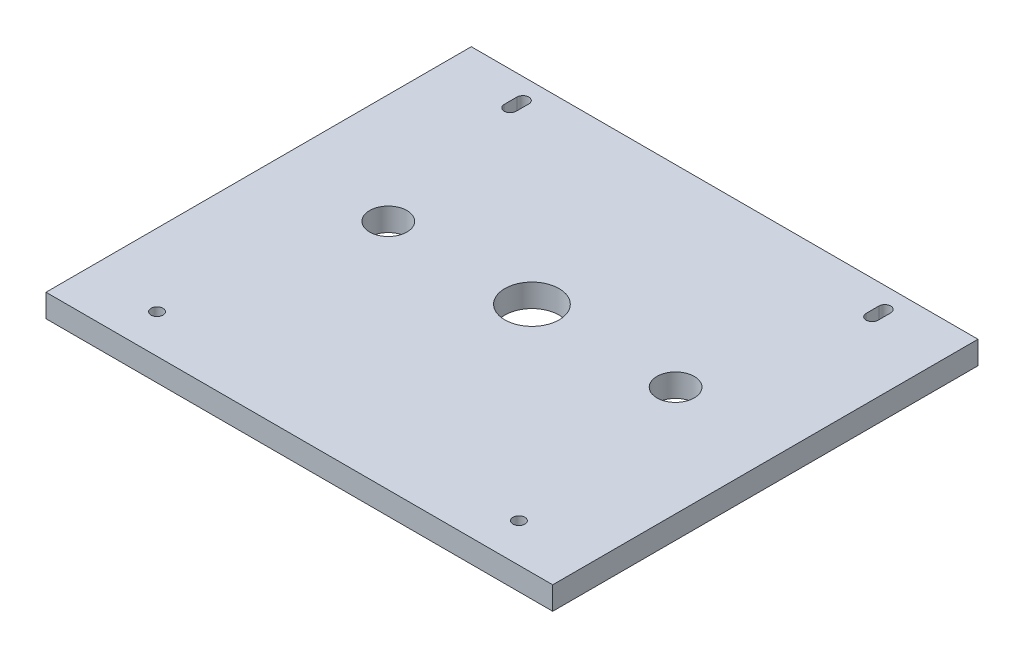
ISO-10303-21;
HEADER;
FILE_DESCRIPTION(('STEP AP214'),'2;1');
FILE_NAME('part.step','',(''),(''),'','','');
FILE_SCHEMA(('AUTOMOTIVE_DESIGN { 1 0 10303 214 1 1 1 1 }'));
ENDSEC;
DATA;
#1=APPLICATION_CONTEXT('core data for automotive mechanical design processes');
#2=APPLICATION_PROTOCOL_DEFINITION('international standard','automotive_design',2000,#1);
#3=PRODUCT_CONTEXT('',#1,'mechanical');
#4=PRODUCT('Part','Part','',(#3));
#5=PRODUCT_RELATED_PRODUCT_CATEGORY('part','',(#4));
#6=PRODUCT_DEFINITION_FORMATION('','',#4);
#7=PRODUCT_DEFINITION_CONTEXT('part definition',#1,'design');
#8=PRODUCT_DEFINITION('design','',#6,#7);
#9=PRODUCT_DEFINITION_SHAPE('','',#8);
#10=(LENGTH_UNIT() NAMED_UNIT(*) SI_UNIT(.MILLI.,.METRE.));
#11=(NAMED_UNIT(*) PLANE_ANGLE_UNIT() SI_UNIT($,.RADIAN.));
#12=(NAMED_UNIT(*) SI_UNIT($,.STERADIAN.) SOLID_ANGLE_UNIT());
#13=UNCERTAINTY_MEASURE_WITH_UNIT(LENGTH_MEASURE(1.E-05),#10,'distance_accuracy_value','');
#14=(GEOMETRIC_REPRESENTATION_CONTEXT(3) GLOBAL_UNCERTAINTY_ASSIGNED_CONTEXT((#13)) GLOBAL_UNIT_ASSIGNED_CONTEXT((#10,
#11,#12)) REPRESENTATION_CONTEXT('',''));
#15=CARTESIAN_POINT('',(0.,0.,0.));
#16=DIRECTION('',(0.,0.,1.));
#17=DIRECTION('',(1.,0.,0.));
#18=AXIS2_PLACEMENT_3D('',#15,#16,#17);
#19=CARTESIAN_POINT('',(0.,6.35,0.));
#20=DIRECTION('',(1.,0.,0.));
#21=DIRECTION('',(0.,0.,-1.));
#22=AXIS2_PLACEMENT_3D('',#19,#20,#21);
#23=PLANE('',#22);
#24=DIRECTION('',(0.,0.,1.));
#25=VECTOR('',#24,1.);
#26=CARTESIAN_POINT('',(0.,0.,0.));
#27=LINE('',#26,#25);
#28=CARTESIAN_POINT('',(0.,0.,-117.505));
#29=VERTEX_POINT('',#28);
#30=CARTESIAN_POINT('',(0.,0.,0.));
#31=VERTEX_POINT('',#30);
#32=EDGE_CURVE('E256',#29,#31,#27,.T.);
#33=ORIENTED_EDGE('',*,*,#32,.T.);
#34=DIRECTION('',(0.,-1.,0.));
#35=VECTOR('',#34,1.);
#36=CARTESIAN_POINT('',(0.,6.35,0.));
#37=LINE('',#36,#35);
#38=CARTESIAN_POINT('',(0.,6.35,0.));
#39=VERTEX_POINT('',#38);
#40=EDGE_CURVE('E11',#39,#31,#37,.T.);
#41=ORIENTED_EDGE('',*,*,#40,.F.);
#42=DIRECTION('',(0.,0.,1.));
#43=VECTOR('',#42,1.);
#44=CARTESIAN_POINT('',(0.,6.35,0.));
#45=LINE('',#44,#43);
#46=CARTESIAN_POINT('',(0.,6.35,-117.505));
#47=VERTEX_POINT('',#46);
#48=EDGE_CURVE('E260',#47,#39,#45,.T.);
#49=ORIENTED_EDGE('',*,*,#48,.F.);
#50=DIRECTION('',(0.,-1.,0.));
#51=VECTOR('',#50,1.);
#52=CARTESIAN_POINT('',(0.,6.35,-117.505));
#53=LINE('',#52,#51);
#54=EDGE_CURVE('E274',#47,#29,#53,.T.);
#55=ORIENTED_EDGE('',*,*,#54,.T.);
#56=EDGE_LOOP('',(#33,#41,#49,#55));
#57=FACE_BOUND('',#56,.T.);
#58=ADVANCED_FACE('F45',(#57),#23,.F.);
#59=CARTESIAN_POINT('',(0.,6.35,0.));
#60=DIRECTION('',(0.,0.,-1.));
#61=DIRECTION('',(-1.,0.,0.));
#62=AXIS2_PLACEMENT_3D('',#59,#60,#61);
#63=PLANE('',#62);
#64=DIRECTION('',(1.,0.,0.));
#65=VECTOR('',#64,1.);
#66=CARTESIAN_POINT('',(0.,0.,0.));
#67=LINE('',#66,#65);
#68=CARTESIAN_POINT('',(140.,0.,0.));
#69=VERTEX_POINT('',#68);
#70=EDGE_CURVE('E278',#31,#69,#67,.T.);
#71=ORIENTED_EDGE('',*,*,#70,.T.);
#72=DIRECTION('',(0.,-1.,0.));
#73=VECTOR('',#72,1.);
#74=CARTESIAN_POINT('',(140.,6.35,0.));
#75=LINE('',#74,#73);
#76=CARTESIAN_POINT('',(140.,6.35,0.));
#77=VERTEX_POINT('',#76);
#78=EDGE_CURVE('E53',#77,#69,#75,.T.);
#79=ORIENTED_EDGE('',*,*,#78,.F.);
#80=DIRECTION('',(1.,0.,0.));
#81=VECTOR('',#80,1.);
#82=CARTESIAN_POINT('',(0.,6.35,0.));
#83=LINE('',#82,#81);
#84=EDGE_CURVE('E264',#39,#77,#83,.T.);
#85=ORIENTED_EDGE('',*,*,#84,.F.);
#86=ORIENTED_EDGE('',*,*,#40,.T.);
#87=EDGE_LOOP('',(#71,#79,#85,#86));
#88=FACE_BOUND('',#87,.T.);
#89=ADVANCED_FACE('F313',(#88),#63,.F.);
#90=CARTESIAN_POINT('',(140.,6.35,0.));
#91=DIRECTION('',(-1.,0.,0.));
#92=DIRECTION('',(0.,0.,1.));
#93=AXIS2_PLACEMENT_3D('',#90,#91,#92);
#94=PLANE('',#93);
#95=DIRECTION('',(0.,0.,-1.));
#96=VECTOR('',#95,1.);
#97=CARTESIAN_POINT('',(140.,0.,0.));
#98=LINE('',#97,#96);
#99=CARTESIAN_POINT('',(140.,0.,-117.505));
#100=VERTEX_POINT('',#99);
#101=EDGE_CURVE('E281',#69,#100,#98,.T.);
#102=ORIENTED_EDGE('',*,*,#101,.T.);
#103=DIRECTION('',(0.,-1.,0.));
#104=VECTOR('',#103,1.);
#105=CARTESIAN_POINT('',(140.,6.35,-117.505));
#106=LINE('',#105,#104);
#107=CARTESIAN_POINT('',(140.,6.35,-117.505));
#108=VERTEX_POINT('',#107);
#109=EDGE_CURVE('E289',#108,#100,#106,.T.);
#110=ORIENTED_EDGE('',*,*,#109,.F.);
#111=DIRECTION('',(0.,0.,-1.));
#112=VECTOR('',#111,1.);
#113=CARTESIAN_POINT('',(140.,6.35,0.));
#114=LINE('',#113,#112);
#115=EDGE_CURVE('E268',#77,#108,#114,.T.);
#116=ORIENTED_EDGE('',*,*,#115,.F.);
#117=ORIENTED_EDGE('',*,*,#78,.T.);
#118=EDGE_LOOP('',(#102,#110,#116,#117));
#119=FACE_BOUND('',#118,.T.);
#120=ADVANCED_FACE('F298',(#119),#94,.F.);
#121=CARTESIAN_POINT('',(0.,6.35,-117.505));
#122=DIRECTION('',(0.,0.,1.));
#123=DIRECTION('',(1.,0.,0.));
#124=AXIS2_PLACEMENT_3D('',#121,#122,#123);
#125=PLANE('',#124);
#126=DIRECTION('',(-1.,0.,0.));
#127=VECTOR('',#126,1.);
#128=CARTESIAN_POINT('',(0.,0.,-117.505));
#129=LINE('',#128,#127);
#130=EDGE_CURVE('E265',#100,#29,#129,.T.);
#131=ORIENTED_EDGE('',*,*,#130,.T.);
#132=ORIENTED_EDGE('',*,*,#54,.F.);
#133=DIRECTION('',(-1.,0.,0.));
#134=VECTOR('',#133,1.);
#135=CARTESIAN_POINT('',(0.,6.35,-117.505));
#136=LINE('',#135,#134);
#137=EDGE_CURVE('E271',#108,#47,#136,.T.);
#138=ORIENTED_EDGE('',*,*,#137,.F.);
#139=ORIENTED_EDGE('',*,*,#109,.T.);
#140=EDGE_LOOP('',(#131,#132,#138,#139));
#141=FACE_BOUND('',#140,.T.);
#142=ADVANCED_FACE('F307',(#141),#125,.F.);
#143=CARTESIAN_POINT('',(0.,6.35,0.));
#144=DIRECTION('',(0.,-1.,0.));
#145=DIRECTION('',(0.,0.,-1.));
#146=AXIS2_PLACEMENT_3D('',#143,#144,#145);
#147=PLANE('',#146);
#148=DIRECTION('',(0.,0.,-1.));
#149=VECTOR('',#148,1.);
#150=CARTESIAN_POINT('',(121.65,6.35,-108.255));
#151=LINE('',#150,#149);
#152=CARTESIAN_POINT('',(121.65,6.35,-108.255));
#153=VERTEX_POINT('',#152);
#154=CARTESIAN_POINT('',(121.65,6.35,-111.755));
#155=VERTEX_POINT('',#154);
#156=EDGE_CURVE('E216',#153,#155,#151,.T.);
#157=ORIENTED_EDGE('',*,*,#156,.F.);
#158=CARTESIAN_POINT('',(120.,6.35,-108.255));
#159=DIRECTION('',(0.,1.,0.));
#160=DIRECTION('',(0.,0.,-1.));
#161=AXIS2_PLACEMENT_3D('',#158,#159,#160);
#162=CIRCLE('',#161,1.65);
#163=CARTESIAN_POINT('',(118.35,6.35,-108.255));
#164=VERTEX_POINT('',#163);
#165=EDGE_CURVE('E60',#164,#153,#162,.T.);
#166=ORIENTED_EDGE('',*,*,#165,.F.);
#167=DIRECTION('',(0.,0.,1.));
#168=VECTOR('',#167,1.);
#169=CARTESIAN_POINT('',(118.35,6.35,-108.255));
#170=LINE('',#169,#168);
#171=CARTESIAN_POINT('',(118.35,6.35,-111.755));
#172=VERTEX_POINT('',#171);
#173=EDGE_CURVE('E207',#172,#164,#170,.T.);
#174=ORIENTED_EDGE('',*,*,#173,.F.);
#175=CARTESIAN_POINT('',(120.,6.35,-111.755));
#176=DIRECTION('',(0.,1.,0.));
#177=DIRECTION('',(0.,0.,-1.));
#178=AXIS2_PLACEMENT_3D('',#175,#176,#177);
#179=CIRCLE('',#178,1.65);
#180=EDGE_CURVE('E211',#155,#172,#179,.T.);
#181=ORIENTED_EDGE('',*,*,#180,.F.);
#182=EDGE_LOOP('',(#157,#166,#174,#181));
#183=FACE_BOUND('',#182,.T.);
#184=CARTESIAN_POINT('',(109.6875,6.35,-64.265));
#185=DIRECTION('',(0.,1.,0.));
#186=DIRECTION('',(0.,0.,-1.));
#187=AXIS2_PLACEMENT_3D('',#184,#185,#186);
#188=CIRCLE('',#187,5.16000000000002);
#189=CARTESIAN_POINT('',(109.6875,6.35,-69.425));
#190=VERTEX_POINT('',#189);
#191=EDGE_CURVE('E189',#190,#190,#188,.T.);
#192=ORIENTED_EDGE('',*,*,#191,.F.);
#193=EDGE_LOOP('',(#192));
#194=FACE_BOUND('',#193,.T.);
#195=CARTESIAN_POINT('',(120.,6.35,-10.675));
#196=DIRECTION('',(0.,1.,0.));
#197=DIRECTION('',(0.,0.,-1.));
#198=AXIS2_PLACEMENT_3D('',#195,#196,#197);
#199=CIRCLE('',#198,1.65);
#200=CARTESIAN_POINT('',(120.,6.35,-12.325));
#201=VERTEX_POINT('',#200);
#202=EDGE_CURVE('E245',#201,#201,#199,.T.);
#203=ORIENTED_EDGE('',*,*,#202,.F.);
#204=EDGE_LOOP('',(#203));
#205=FACE_BOUND('',#204,.T.);
#206=CARTESIAN_POINT('',(30.3125,6.35,-64.265));
#207=DIRECTION('',(0.,1.,0.));
#208=DIRECTION('',(0.,0.,1.));
#209=AXIS2_PLACEMENT_3D('',#206,#207,#208);
#210=CIRCLE('',#209,5.16000000000001);
#211=CARTESIAN_POINT('',(30.3125,6.35,-59.105));
#212=VERTEX_POINT('',#211);
#213=EDGE_CURVE('E236',#212,#212,#210,.T.);
#214=ORIENTED_EDGE('',*,*,#213,.F.);
#215=EDGE_LOOP('',(#214));
#216=FACE_BOUND('',#215,.T.);
#217=DIRECTION('',(0.,0.,-1.));
#218=VECTOR('',#217,1.);
#219=CARTESIAN_POINT('',(21.6499999999999,6.35,-108.255));
#220=LINE('',#219,#218);
#221=CARTESIAN_POINT('',(21.6499999999999,6.35,-108.255));
#222=VERTEX_POINT('',#221);
#223=CARTESIAN_POINT('',(21.6499999999999,6.35,-111.755));
#224=VERTEX_POINT('',#223);
#225=EDGE_CURVE('E157',#222,#224,#220,.T.);
#226=ORIENTED_EDGE('',*,*,#225,.F.);
#227=CARTESIAN_POINT('',(19.9999999999999,6.35,-108.255));
#228=DIRECTION('',(0.,1.,0.));
#229=DIRECTION('',(0.,0.,1.));
#230=AXIS2_PLACEMENT_3D('',#227,#228,#229);
#231=CIRCLE('',#230,1.65);
#232=CARTESIAN_POINT('',(18.3499999999999,6.35,-108.255));
#233=VERTEX_POINT('',#232);
#234=EDGE_CURVE('E68',#233,#222,#231,.T.);
#235=ORIENTED_EDGE('',*,*,#234,.F.);
#236=DIRECTION('',(0.,0.,1.));
#237=VECTOR('',#236,1.);
#238=CARTESIAN_POINT('',(18.3499999999999,6.35,-108.255));
#239=LINE('',#238,#237);
#240=CARTESIAN_POINT('',(18.3499999999999,6.35,-111.755));
#241=VERTEX_POINT('',#240);
#242=EDGE_CURVE('E145',#241,#233,#239,.T.);
#243=ORIENTED_EDGE('',*,*,#242,.F.);
#244=CARTESIAN_POINT('',(19.9999999999999,6.35,-111.755));
#245=DIRECTION('',(0.,1.,0.));
#246=DIRECTION('',(0.,0.,1.));
#247=AXIS2_PLACEMENT_3D('',#244,#245,#246);
#248=CIRCLE('',#247,1.65);
#249=EDGE_CURVE('E151',#224,#241,#248,.T.);
#250=ORIENTED_EDGE('',*,*,#249,.F.);
#251=EDGE_LOOP('',(#226,#235,#243,#250));
#252=FACE_BOUND('',#251,.T.);
#253=CARTESIAN_POINT('',(70.,6.35,-64.265));
#254=DIRECTION('',(0.,1.,0.));
#255=DIRECTION('',(0.,0.,1.));
#256=AXIS2_PLACEMENT_3D('',#253,#254,#255);
#257=CIRCLE('',#256,7.50000000000001);
#258=CARTESIAN_POINT('',(70.,6.35,-56.765));
#259=VERTEX_POINT('',#258);
#260=EDGE_CURVE('E142',#259,#259,#257,.T.);
#261=ORIENTED_EDGE('',*,*,#260,.F.);
#262=EDGE_LOOP('',(#261));
#263=FACE_BOUND('',#262,.T.);
#264=CARTESIAN_POINT('',(20.,6.35,-10.675));
#265=DIRECTION('',(0.,1.,0.));
#266=DIRECTION('',(0.,0.,1.));
#267=AXIS2_PLACEMENT_3D('',#264,#265,#266);
#268=CIRCLE('',#267,1.65);
#269=CARTESIAN_POINT('',(20.,6.35,-9.025));
#270=VERTEX_POINT('',#269);
#271=EDGE_CURVE('E240',#270,#270,#268,.T.);
#272=ORIENTED_EDGE('',*,*,#271,.F.);
#273=EDGE_LOOP('',(#272));
#274=FACE_BOUND('',#273,.T.);
#275=ORIENTED_EDGE('',*,*,#48,.T.);
#276=ORIENTED_EDGE('',*,*,#84,.T.);
#277=ORIENTED_EDGE('',*,*,#115,.T.);
#278=ORIENTED_EDGE('',*,*,#137,.T.);
#279=EDGE_LOOP('',(#275,#276,#277,#278));
#280=FACE_BOUND('',#279,.T.);
#281=ADVANCED_FACE('F154',(#183,#194,#205,#216,#252,#263,#274,#280),#147,.F.);
#282=CARTESIAN_POINT('',(0.,0.,0.));
#283=DIRECTION('',(0.,-1.,0.));
#284=DIRECTION('',(0.,0.,-1.));
#285=AXIS2_PLACEMENT_3D('',#282,#283,#284);
#286=PLANE('',#285);
#287=CARTESIAN_POINT('',(120.,0.,-108.255));
#288=DIRECTION('',(0.,1.,0.));
#289=DIRECTION('',(0.,0.,-1.));
#290=AXIS2_PLACEMENT_3D('',#287,#288,#289);
#291=CIRCLE('',#290,1.65);
#292=CARTESIAN_POINT('',(118.35,0.,-108.255));
#293=VERTEX_POINT('',#292);
#294=CARTESIAN_POINT('',(121.65,0.,-108.255));
#295=VERTEX_POINT('',#294);
#296=EDGE_CURVE('E212',#293,#295,#291,.T.);
#297=ORIENTED_EDGE('',*,*,#296,.T.);
#298=DIRECTION('',(0.,0.,-1.));
#299=VECTOR('',#298,1.);
#300=CARTESIAN_POINT('',(121.65,0.,-108.255));
#301=LINE('',#300,#299);
#302=CARTESIAN_POINT('',(121.65,0.,-111.755));
#303=VERTEX_POINT('',#302);
#304=EDGE_CURVE('E229',#295,#303,#301,.T.);
#305=ORIENTED_EDGE('',*,*,#304,.T.);
#306=CARTESIAN_POINT('',(120.,0.,-111.755));
#307=DIRECTION('',(0.,1.,0.));
#308=DIRECTION('',(0.,0.,-1.));
#309=AXIS2_PLACEMENT_3D('',#306,#307,#308);
#310=CIRCLE('',#309,1.65);
#311=CARTESIAN_POINT('',(118.35,0.,-111.755));
#312=VERTEX_POINT('',#311);
#313=EDGE_CURVE('E225',#303,#312,#310,.T.);
#314=ORIENTED_EDGE('',*,*,#313,.T.);
#315=DIRECTION('',(0.,0.,1.));
#316=VECTOR('',#315,1.);
#317=CARTESIAN_POINT('',(118.35,0.,-108.255));
#318=LINE('',#317,#316);
#319=EDGE_CURVE('E201',#312,#293,#318,.T.);
#320=ORIENTED_EDGE('',*,*,#319,.T.);
#321=EDGE_LOOP('',(#297,#305,#314,#320));
#322=FACE_BOUND('',#321,.T.);
#323=CARTESIAN_POINT('',(109.6875,0.,-64.265));
#324=DIRECTION('',(0.,1.,0.));
#325=DIRECTION('',(0.,0.,-1.));
#326=AXIS2_PLACEMENT_3D('',#323,#324,#325);
#327=CIRCLE('',#326,5.16000000000002);
#328=CARTESIAN_POINT('',(109.6875,0.,-69.425));
#329=VERTEX_POINT('',#328);
#330=EDGE_CURVE('E194',#329,#329,#327,.T.);
#331=ORIENTED_EDGE('',*,*,#330,.T.);
#332=EDGE_LOOP('',(#331));
#333=FACE_BOUND('',#332,.T.);
#334=CARTESIAN_POINT('',(120.,0.,-10.675));
#335=DIRECTION('',(0.,1.,0.));
#336=DIRECTION('',(0.,0.,-1.));
#337=AXIS2_PLACEMENT_3D('',#334,#335,#336);
#338=CIRCLE('',#337,1.65);
#339=CARTESIAN_POINT('',(120.,0.,-12.325));
#340=VERTEX_POINT('',#339);
#341=EDGE_CURVE('E193',#340,#340,#338,.T.);
#342=ORIENTED_EDGE('',*,*,#341,.T.);
#343=EDGE_LOOP('',(#342));
#344=FACE_BOUND('',#343,.T.);
#345=CARTESIAN_POINT('',(30.3125,0.,-64.265));
#346=DIRECTION('',(0.,1.,0.));
#347=DIRECTION('',(0.,0.,1.));
#348=AXIS2_PLACEMENT_3D('',#345,#346,#347);
#349=CIRCLE('',#348,5.16000000000001);
#350=CARTESIAN_POINT('',(30.3125,0.,-59.105));
#351=VERTEX_POINT('',#350);
#352=EDGE_CURVE('E241',#351,#351,#349,.T.);
#353=ORIENTED_EDGE('',*,*,#352,.T.);
#354=EDGE_LOOP('',(#353));
#355=FACE_BOUND('',#354,.T.);
#356=CARTESIAN_POINT('',(19.9999999999999,0.,-108.255));
#357=DIRECTION('',(0.,1.,0.));
#358=DIRECTION('',(0.,0.,1.));
#359=AXIS2_PLACEMENT_3D('',#356,#357,#358);
#360=CIRCLE('',#359,1.65);
#361=CARTESIAN_POINT('',(18.3499999999999,0.,-108.255));
#362=VERTEX_POINT('',#361);
#363=CARTESIAN_POINT('',(21.6499999999999,0.,-108.255));
#364=VERTEX_POINT('',#363);
#365=EDGE_CURVE('E136',#362,#364,#360,.T.);
#366=ORIENTED_EDGE('',*,*,#365,.T.);
#367=DIRECTION('',(0.,0.,-1.));
#368=VECTOR('',#367,1.);
#369=CARTESIAN_POINT('',(21.6499999999999,0.,-108.255));
#370=LINE('',#369,#368);
#371=CARTESIAN_POINT('',(21.6499999999999,0.,-111.755));
#372=VERTEX_POINT('',#371);
#373=EDGE_CURVE('E176',#364,#372,#370,.T.);
#374=ORIENTED_EDGE('',*,*,#373,.T.);
#375=CARTESIAN_POINT('',(19.9999999999999,0.,-111.755));
#376=DIRECTION('',(0.,1.,0.));
#377=DIRECTION('',(0.,0.,1.));
#378=AXIS2_PLACEMENT_3D('',#375,#376,#377);
#379=CIRCLE('',#378,1.65);
#380=CARTESIAN_POINT('',(18.3499999999999,0.,-111.755));
#381=VERTEX_POINT('',#380);
#382=EDGE_CURVE('E171',#372,#381,#379,.T.);
#383=ORIENTED_EDGE('',*,*,#382,.T.);
#384=DIRECTION('',(0.,0.,1.));
#385=VECTOR('',#384,1.);
#386=CARTESIAN_POINT('',(18.3499999999999,0.,-108.255));
#387=LINE('',#386,#385);
#388=EDGE_CURVE('E168',#381,#362,#387,.T.);
#389=ORIENTED_EDGE('',*,*,#388,.T.);
#390=EDGE_LOOP('',(#366,#374,#383,#389));
#391=FACE_BOUND('',#390,.T.);
#392=CARTESIAN_POINT('',(70.,0.,-64.265));
#393=DIRECTION('',(0.,1.,0.));
#394=DIRECTION('',(0.,0.,1.));
#395=AXIS2_PLACEMENT_3D('',#392,#393,#394);
#396=CIRCLE('',#395,7.50000000000001);
#397=CARTESIAN_POINT('',(70.,0.,-56.765));
#398=VERTEX_POINT('',#397);
#399=EDGE_CURVE('E185',#398,#398,#396,.T.);
#400=ORIENTED_EDGE('',*,*,#399,.T.);
#401=EDGE_LOOP('',(#400));
#402=FACE_BOUND('',#401,.T.);
#403=CARTESIAN_POINT('',(20.,0.,-10.675));
#404=DIRECTION('',(0.,1.,0.));
#405=DIRECTION('',(0.,0.,1.));
#406=AXIS2_PLACEMENT_3D('',#403,#404,#405);
#407=CIRCLE('',#406,1.65);
#408=CARTESIAN_POINT('',(20.,0.,-9.025));
#409=VERTEX_POINT('',#408);
#410=EDGE_CURVE('E252',#409,#409,#407,.T.);
#411=ORIENTED_EDGE('',*,*,#410,.T.);
#412=EDGE_LOOP('',(#411));
#413=FACE_BOUND('',#412,.T.);
#414=ORIENTED_EDGE('',*,*,#32,.F.);
#415=ORIENTED_EDGE('',*,*,#130,.F.);
#416=ORIENTED_EDGE('',*,*,#101,.F.);
#417=ORIENTED_EDGE('',*,*,#70,.F.);
#418=EDGE_LOOP('',(#414,#415,#416,#417));
#419=FACE_BOUND('',#418,.T.);
#420=ADVANCED_FACE('F304',(#322,#333,#344,#355,#391,#402,#413,#419),#286,.T.);
#421=CARTESIAN_POINT('',(20.,0.,-10.675));
#422=DIRECTION('',(0.,1.,0.));
#423=DIRECTION('',(0.,0.,1.));
#424=AXIS2_PLACEMENT_3D('',#421,#422,#423);
#425=CYLINDRICAL_SURFACE('',#424,1.65);
#426=ORIENTED_EDGE('',*,*,#410,.F.);
#427=EDGE_LOOP('',(#426));
#428=FACE_BOUND('',#427,.T.);
#429=ORIENTED_EDGE('',*,*,#271,.T.);
#430=EDGE_LOOP('',(#429));
#431=FACE_BOUND('',#430,.T.);
#432=ADVANCED_FACE('F325',(#428,#431),#425,.F.);
#433=CARTESIAN_POINT('',(70.,0.,-64.265));
#434=DIRECTION('',(0.,1.,0.));
#435=DIRECTION('',(0.,0.,1.));
#436=AXIS2_PLACEMENT_3D('',#433,#434,#435);
#437=CYLINDRICAL_SURFACE('',#436,7.50000000000001);
#438=ORIENTED_EDGE('',*,*,#399,.F.);
#439=EDGE_LOOP('',(#438));
#440=FACE_BOUND('',#439,.T.);
#441=ORIENTED_EDGE('',*,*,#260,.T.);
#442=EDGE_LOOP('',(#441));
#443=FACE_BOUND('',#442,.T.);
#444=ADVANCED_FACE('F332',(#440,#443),#437,.F.);
#445=CARTESIAN_POINT('',(19.9999999999999,0.,-108.255));
#446=DIRECTION('',(0.,1.,0.));
#447=DIRECTION('',(0.,0.,1.));
#448=AXIS2_PLACEMENT_3D('',#445,#446,#447);
#449=CYLINDRICAL_SURFACE('',#448,1.65);
#450=ORIENTED_EDGE('',*,*,#234,.T.);
#451=DIRECTION('',(0.,1.,0.));
#452=VECTOR('',#451,1.);
#453=CARTESIAN_POINT('',(21.6499999999999,0.,-108.255));
#454=LINE('',#453,#452);
#455=EDGE_CURVE('E172',#364,#222,#454,.T.);
#456=ORIENTED_EDGE('',*,*,#455,.F.);
#457=ORIENTED_EDGE('',*,*,#365,.F.);
#458=DIRECTION('',(0.,1.,0.));
#459=VECTOR('',#458,1.);
#460=CARTESIAN_POINT('',(18.3499999999999,0.,-108.255));
#461=LINE('',#460,#459);
#462=EDGE_CURVE('E132',#362,#233,#461,.T.);
#463=ORIENTED_EDGE('',*,*,#462,.T.);
#464=EDGE_LOOP('',(#450,#456,#457,#463));
#465=FACE_BOUND('',#464,.T.);
#466=ADVANCED_FACE('F134',(#465),#449,.F.);
#467=CARTESIAN_POINT('',(18.3499999999999,0.,-108.255));
#468=DIRECTION('',(-1.,0.,0.));
#469=DIRECTION('',(0.,0.,1.));
#470=AXIS2_PLACEMENT_3D('',#467,#468,#469);
#471=PLANE('',#470);
#472=ORIENTED_EDGE('',*,*,#242,.T.);
#473=ORIENTED_EDGE('',*,*,#462,.F.);
#474=ORIENTED_EDGE('',*,*,#388,.F.);
#475=DIRECTION('',(0.,1.,0.));
#476=VECTOR('',#475,1.);
#477=CARTESIAN_POINT('',(18.3499999999999,0.,-111.755));
#478=LINE('',#477,#476);
#479=EDGE_CURVE('E141',#381,#241,#478,.T.);
#480=ORIENTED_EDGE('',*,*,#479,.T.);
#481=EDGE_LOOP('',(#472,#473,#474,#480));
#482=FACE_BOUND('',#481,.T.);
#483=ADVANCED_FACE('F146',(#482),#471,.F.);
#484=CARTESIAN_POINT('',(19.9999999999999,0.,-111.755));
#485=DIRECTION('',(0.,1.,0.));
#486=DIRECTION('',(0.,0.,1.));
#487=AXIS2_PLACEMENT_3D('',#484,#485,#486);
#488=CYLINDRICAL_SURFACE('',#487,1.65);
#489=ORIENTED_EDGE('',*,*,#249,.T.);
#490=ORIENTED_EDGE('',*,*,#479,.F.);
#491=ORIENTED_EDGE('',*,*,#382,.F.);
#492=DIRECTION('',(0.,1.,0.));
#493=VECTOR('',#492,1.);
#494=CARTESIAN_POINT('',(21.6499999999999,0.,-111.755));
#495=LINE('',#494,#493);
#496=EDGE_CURVE('E489',#372,#224,#495,.T.);
#497=ORIENTED_EDGE('',*,*,#496,.T.);
#498=EDGE_LOOP('',(#489,#490,#491,#497));
#499=FACE_BOUND('',#498,.T.);
#500=ADVANCED_FACE('F367',(#499),#488,.F.);
#501=CARTESIAN_POINT('',(21.6499999999999,0.,-108.255));
#502=DIRECTION('',(1.,0.,0.));
#503=DIRECTION('',(0.,0.,-1.));
#504=AXIS2_PLACEMENT_3D('',#501,#502,#503);
#505=PLANE('',#504);
#506=ORIENTED_EDGE('',*,*,#225,.T.);
#507=ORIENTED_EDGE('',*,*,#496,.F.);
#508=ORIENTED_EDGE('',*,*,#373,.F.);
#509=ORIENTED_EDGE('',*,*,#455,.T.);
#510=EDGE_LOOP('',(#506,#507,#508,#509));
#511=FACE_BOUND('',#510,.T.);
#512=ADVANCED_FACE('F342',(#511),#505,.F.);
#513=CARTESIAN_POINT('',(30.3125,0.,-64.265));
#514=DIRECTION('',(0.,1.,0.));
#515=DIRECTION('',(0.,0.,1.));
#516=AXIS2_PLACEMENT_3D('',#513,#514,#515);
#517=CYLINDRICAL_SURFACE('',#516,5.16000000000001);
#518=ORIENTED_EDGE('',*,*,#352,.F.);
#519=EDGE_LOOP('',(#518));
#520=FACE_BOUND('',#519,.T.);
#521=ORIENTED_EDGE('',*,*,#213,.T.);
#522=EDGE_LOOP('',(#521));
#523=FACE_BOUND('',#522,.T.);
#524=ADVANCED_FACE('F338',(#520,#523),#517,.F.);
#525=CARTESIAN_POINT('',(120.,0.,-10.675));
#526=DIRECTION('',(0.,1.,0.));
#527=DIRECTION('',(0.,0.,1.));
#528=AXIS2_PLACEMENT_3D('',#525,#526,#527);
#529=CYLINDRICAL_SURFACE('',#528,1.65);
#530=ORIENTED_EDGE('',*,*,#341,.F.);
#531=EDGE_LOOP('',(#530));
#532=FACE_BOUND('',#531,.T.);
#533=ORIENTED_EDGE('',*,*,#202,.T.);
#534=EDGE_LOOP('',(#533));
#535=FACE_BOUND('',#534,.T.);
#536=ADVANCED_FACE('F334',(#532,#535),#529,.F.);
#537=CARTESIAN_POINT('',(109.6875,0.,-64.265));
#538=DIRECTION('',(0.,1.,0.));
#539=DIRECTION('',(0.,0.,1.));
#540=AXIS2_PLACEMENT_3D('',#537,#538,#539);
#541=CYLINDRICAL_SURFACE('',#540,5.16000000000002);
#542=ORIENTED_EDGE('',*,*,#330,.F.);
#543=EDGE_LOOP('',(#542));
#544=FACE_BOUND('',#543,.T.);
#545=ORIENTED_EDGE('',*,*,#191,.T.);
#546=EDGE_LOOP('',(#545));
#547=FACE_BOUND('',#546,.T.);
#548=ADVANCED_FACE('F337',(#544,#547),#541,.F.);
#549=CARTESIAN_POINT('',(120.,0.,-108.255));
#550=DIRECTION('',(0.,1.,0.));
#551=DIRECTION('',(0.,0.,1.));
#552=AXIS2_PLACEMENT_3D('',#549,#550,#551);
#553=CYLINDRICAL_SURFACE('',#552,1.65);
#554=ORIENTED_EDGE('',*,*,#165,.T.);
#555=DIRECTION('',(0.,1.,0.));
#556=VECTOR('',#555,1.);
#557=CARTESIAN_POINT('',(121.65,0.,-108.255));
#558=LINE('',#557,#556);
#559=EDGE_CURVE('E198',#295,#153,#558,.T.);
#560=ORIENTED_EDGE('',*,*,#559,.F.);
#561=ORIENTED_EDGE('',*,*,#296,.F.);
#562=DIRECTION('',(0.,1.,0.));
#563=VECTOR('',#562,1.);
#564=CARTESIAN_POINT('',(118.35,0.,-108.255));
#565=LINE('',#564,#563);
#566=EDGE_CURVE('E159',#293,#164,#565,.T.);
#567=ORIENTED_EDGE('',*,*,#566,.T.);
#568=EDGE_LOOP('',(#554,#560,#561,#567));
#569=FACE_BOUND('',#568,.T.);
#570=ADVANCED_FACE('F348',(#569),#553,.F.);
#571=CARTESIAN_POINT('',(118.35,0.,-108.255));
#572=DIRECTION('',(-1.,0.,0.));
#573=DIRECTION('',(0.,0.,1.));
#574=AXIS2_PLACEMENT_3D('',#571,#572,#573);
#575=PLANE('',#574);
#576=ORIENTED_EDGE('',*,*,#173,.T.);
#577=ORIENTED_EDGE('',*,*,#566,.F.);
#578=ORIENTED_EDGE('',*,*,#319,.F.);
#579=DIRECTION('',(0.,1.,0.));
#580=VECTOR('',#579,1.);
#581=CARTESIAN_POINT('',(118.35,0.,-111.755));
#582=LINE('',#581,#580);
#583=EDGE_CURVE('E163',#312,#172,#582,.T.);
#584=ORIENTED_EDGE('',*,*,#583,.T.);
#585=EDGE_LOOP('',(#576,#577,#578,#584));
#586=FACE_BOUND('',#585,.T.);
#587=ADVANCED_FACE('F344',(#586),#575,.F.);
#588=CARTESIAN_POINT('',(120.,0.,-111.755));
#589=DIRECTION('',(0.,1.,0.));
#590=DIRECTION('',(0.,0.,1.));
#591=AXIS2_PLACEMENT_3D('',#588,#589,#590);
#592=CYLINDRICAL_SURFACE('',#591,1.65);
#593=ORIENTED_EDGE('',*,*,#180,.T.);
#594=ORIENTED_EDGE('',*,*,#583,.F.);
#595=ORIENTED_EDGE('',*,*,#313,.F.);
#596=DIRECTION('',(0.,1.,0.));
#597=VECTOR('',#596,1.);
#598=CARTESIAN_POINT('',(121.65,0.,-111.755));
#599=LINE('',#598,#597);
#600=EDGE_CURVE('E202',#303,#155,#599,.T.);
#601=ORIENTED_EDGE('',*,*,#600,.T.);
#602=EDGE_LOOP('',(#593,#594,#595,#601));
#603=FACE_BOUND('',#602,.T.);
#604=ADVANCED_FACE('F347',(#603),#592,.F.);
#605=CARTESIAN_POINT('',(121.65,0.,-108.255));
#606=DIRECTION('',(1.,0.,0.));
#607=DIRECTION('',(0.,0.,-1.));
#608=AXIS2_PLACEMENT_3D('',#605,#606,#607);
#609=PLANE('',#608);
#610=ORIENTED_EDGE('',*,*,#156,.T.);
#611=ORIENTED_EDGE('',*,*,#600,.F.);
#612=ORIENTED_EDGE('',*,*,#304,.F.);
#613=ORIENTED_EDGE('',*,*,#559,.T.);
#614=EDGE_LOOP('',(#610,#611,#612,#613));
#615=FACE_BOUND('',#614,.T.);
#616=ADVANCED_FACE('F352',(#615),#609,.F.);
#617=CLOSED_SHELL('',(#58,#89,#120,#142,#281,#420,#432,#444,#466,#483,#500,#512,#524,#536,#548,
#570,#587,#604,#616));
#618=MANIFOLD_SOLID_BREP('B2',#617);
#619=ADVANCED_BREP_SHAPE_REPRESENTATION('',(#18,#618),#14);
#620=SHAPE_DEFINITION_REPRESENTATION(#9,#619);
ENDSEC;
END-ISO-10303-21;
